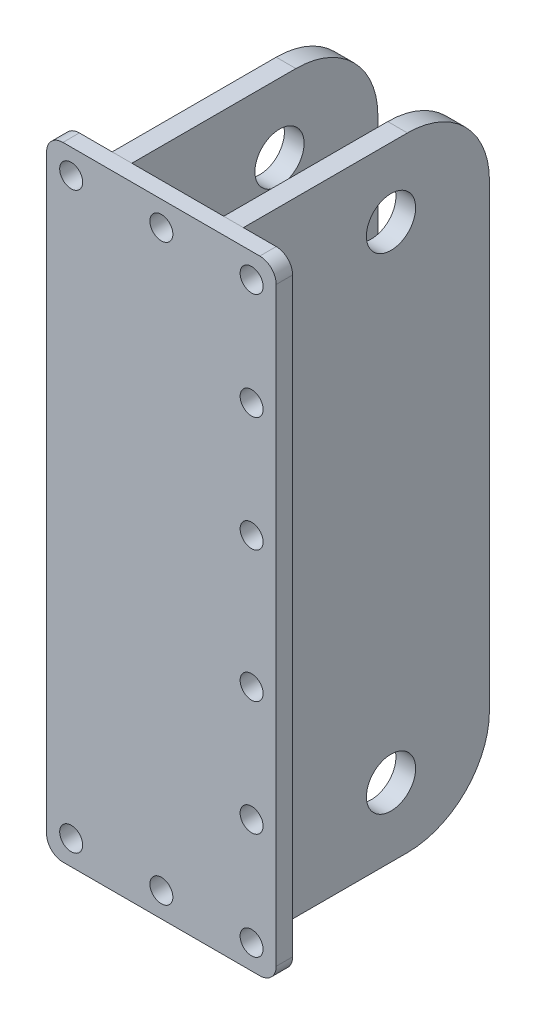
ISO-10303-21;
HEADER;
FILE_DESCRIPTION(('STEP AP214'),'2;1');
FILE_NAME('part.step','',(''),(''),'','','');
FILE_SCHEMA(('AUTOMOTIVE_DESIGN { 1 0 10303 214 1 1 1 1 }'));
ENDSEC;
DATA;
#1=APPLICATION_CONTEXT('core data for automotive mechanical design processes');
#2=APPLICATION_PROTOCOL_DEFINITION('international standard','automotive_design',2000,#1);
#3=PRODUCT_CONTEXT('',#1,'mechanical');
#4=PRODUCT('Part','Part','',(#3));
#5=PRODUCT_RELATED_PRODUCT_CATEGORY('part','',(#4));
#6=PRODUCT_DEFINITION_FORMATION('','',#4);
#7=PRODUCT_DEFINITION_CONTEXT('part definition',#1,'design');
#8=PRODUCT_DEFINITION('design','',#6,#7);
#9=PRODUCT_DEFINITION_SHAPE('','',#8);
#10=(LENGTH_UNIT() NAMED_UNIT(*) SI_UNIT(.MILLI.,.METRE.));
#11=(NAMED_UNIT(*) PLANE_ANGLE_UNIT() SI_UNIT($,.RADIAN.));
#12=(NAMED_UNIT(*) SI_UNIT($,.STERADIAN.) SOLID_ANGLE_UNIT());
#13=UNCERTAINTY_MEASURE_WITH_UNIT(LENGTH_MEASURE(1.E-05),#10,'distance_accuracy_value','');
#14=(GEOMETRIC_REPRESENTATION_CONTEXT(3) GLOBAL_UNCERTAINTY_ASSIGNED_CONTEXT((#13)) GLOBAL_UNIT_ASSIGNED_CONTEXT((#10,
#11,#12)) REPRESENTATION_CONTEXT('',''));
#15=CARTESIAN_POINT('',(0.,0.,0.));
#16=DIRECTION('',(0.,0.,1.));
#17=DIRECTION('',(1.,0.,0.));
#18=AXIS2_PLACEMENT_3D('',#15,#16,#17);
#19=CARTESIAN_POINT('',(42.,380.,-150.));
#20=DIRECTION('',(-1.,0.,0.));
#21=DIRECTION('',(0.,-1.,0.));
#22=AXIS2_PLACEMENT_3D('',#19,#20,#21);
#23=PLANE('',#22);
#24=CARTESIAN_POINT('',(42.,338.,-90.));
#25=DIRECTION('',(-1.,0.,0.));
#26=DIRECTION('',(0.,-1.,0.));
#27=AXIS2_PLACEMENT_3D('',#24,#25,#26);
#28=CIRCLE('',#27,15.);
#29=CARTESIAN_POINT('',(42.,323.,-90.));
#30=VERTEX_POINT('',#29);
#31=EDGE_CURVE('E116',#30,#30,#28,.F.);
#32=ORIENTED_EDGE('',*,*,#31,.F.);
#33=EDGE_LOOP('',(#32));
#34=FACE_BOUND('',#33,.T.);
#35=CARTESIAN_POINT('',(41.9999999999999,42.,-89.9999999999999));
#36=DIRECTION('',(-1.,0.,0.));
#37=DIRECTION('',(0.,-1.,0.));
#38=AXIS2_PLACEMENT_3D('',#35,#36,#37);
#39=CIRCLE('',#38,15.);
#40=CARTESIAN_POINT('',(41.9999999999999,27.,-89.9999999999999));
#41=VERTEX_POINT('',#40);
#42=EDGE_CURVE('E199',#41,#41,#39,.F.);
#43=ORIENTED_EDGE('',*,*,#42,.F.);
#44=EDGE_LOOP('',(#43));
#45=FACE_BOUND('',#44,.T.);
#46=DIRECTION('',(0.,0.,1.));
#47=VECTOR('',#46,1.);
#48=CARTESIAN_POINT('',(41.9999999999999,0.,-150.));
#49=LINE('',#48,#47);
#50=CARTESIAN_POINT('',(41.9999999999999,0.,-100.));
#51=VERTEX_POINT('',#50);
#52=CARTESIAN_POINT('',(41.9999999999999,0.,0.));
#53=VERTEX_POINT('',#52);
#54=EDGE_CURVE('E96',#51,#53,#49,.T.);
#55=ORIENTED_EDGE('',*,*,#54,.F.);
#56=CARTESIAN_POINT('',(42.,50.,-100.));
#57=DIRECTION('',(-1.,0.,0.));
#58=DIRECTION('',(0.,-1.,0.));
#59=AXIS2_PLACEMENT_3D('',#56,#57,#58);
#60=CIRCLE('',#59,50.);
#61=CARTESIAN_POINT('',(42.,50.,-150.));
#62=VERTEX_POINT('',#61);
#63=EDGE_CURVE('E53',#51,#62,#60,.F.);
#64=ORIENTED_EDGE('',*,*,#63,.T.);
#65=DIRECTION('',(0.,-1.,0.));
#66=VECTOR('',#65,1.);
#67=CARTESIAN_POINT('',(42.,380.,-150.));
#68=LINE('',#67,#66);
#69=CARTESIAN_POINT('',(42.,330.,-150.));
#70=VERTEX_POINT('',#69);
#71=EDGE_CURVE('E128',#70,#62,#68,.T.);
#72=ORIENTED_EDGE('',*,*,#71,.F.);
#73=CARTESIAN_POINT('',(42.,330.,-100.));
#74=DIRECTION('',(-1.,0.,0.));
#75=DIRECTION('',(0.,-1.,0.));
#76=AXIS2_PLACEMENT_3D('',#73,#74,#75);
#77=CIRCLE('',#76,50.);
#78=CARTESIAN_POINT('',(42.,380.,-100.));
#79=VERTEX_POINT('',#78);
#80=EDGE_CURVE('E60',#70,#79,#77,.F.);
#81=ORIENTED_EDGE('',*,*,#80,.T.);
#82=DIRECTION('',(0.,0.,1.));
#83=VECTOR('',#82,1.);
#84=CARTESIAN_POINT('',(42.,380.,-150.));
#85=LINE('',#84,#83);
#86=CARTESIAN_POINT('',(42.,380.,0.));
#87=VERTEX_POINT('',#86);
#88=EDGE_CURVE('E114',#79,#87,#85,.T.);
#89=ORIENTED_EDGE('',*,*,#88,.T.);
#90=DIRECTION('',(0.,-1.,0.));
#91=VECTOR('',#90,1.);
#92=CARTESIAN_POINT('',(42.,380.,0.));
#93=LINE('',#92,#91);
#94=EDGE_CURVE('E110',#87,#53,#93,.T.);
#95=ORIENTED_EDGE('',*,*,#94,.T.);
#96=EDGE_LOOP('',(#55,#64,#72,#81,#89,#95));
#97=FACE_BOUND('',#96,.T.);
#98=ADVANCED_FACE('F45',(#34,#45,#97),#23,.F.);
#99=CARTESIAN_POINT('',(41.9999999999999,0.,-150.));
#100=DIRECTION('',(0.,1.,0.));
#101=DIRECTION('',(-1.,0.,0.));
#102=AXIS2_PLACEMENT_3D('',#99,#100,#101);
#103=PLANE('',#102);
#104=DIRECTION('',(0.,0.,1.));
#105=VECTOR('',#104,1.);
#106=CARTESIAN_POINT('',(30.,0.,-150.));
#107=LINE('',#106,#105);
#108=CARTESIAN_POINT('',(30.,0.,-100.));
#109=VERTEX_POINT('',#108);
#110=CARTESIAN_POINT('',(30.,0.,0.));
#111=VERTEX_POINT('',#110);
#112=EDGE_CURVE('E104',#109,#111,#107,.T.);
#113=ORIENTED_EDGE('',*,*,#112,.F.);
#114=DIRECTION('',(-1.,0.,0.));
#115=VECTOR('',#114,1.);
#116=CARTESIAN_POINT('',(41.9999999999999,0.,-100.));
#117=LINE('',#116,#115);
#118=EDGE_CURVE('E68',#109,#51,#117,.F.);
#119=ORIENTED_EDGE('',*,*,#118,.T.);
#120=ORIENTED_EDGE('',*,*,#54,.T.);
#121=DIRECTION('',(-1.,0.,0.));
#122=VECTOR('',#121,1.);
#123=CARTESIAN_POINT('',(41.9999999999999,0.,0.));
#124=LINE('',#123,#122);
#125=EDGE_CURVE('E99',#53,#111,#124,.T.);
#126=ORIENTED_EDGE('',*,*,#125,.T.);
#127=EDGE_LOOP('',(#113,#119,#120,#126));
#128=FACE_BOUND('',#127,.T.);
#129=ADVANCED_FACE('F98',(#128),#103,.F.);
#130=CARTESIAN_POINT('',(30.,380.,-150.));
#131=DIRECTION('',(1.,0.,0.));
#132=DIRECTION('',(0.,1.,0.));
#133=AXIS2_PLACEMENT_3D('',#130,#131,#132);
#134=PLANE('',#133);
#135=CARTESIAN_POINT('',(30.,338.,-90.));
#136=DIRECTION('',(-1.,0.,0.));
#137=DIRECTION('',(0.,-1.,0.));
#138=AXIS2_PLACEMENT_3D('',#135,#136,#137);
#139=CIRCLE('',#138,15.);
#140=CARTESIAN_POINT('',(30.,323.,-90.));
#141=VERTEX_POINT('',#140);
#142=EDGE_CURVE('E119',#141,#141,#139,.T.);
#143=ORIENTED_EDGE('',*,*,#142,.F.);
#144=EDGE_LOOP('',(#143));
#145=FACE_BOUND('',#144,.T.);
#146=CARTESIAN_POINT('',(30.,42.,-89.9999999999999));
#147=DIRECTION('',(-1.,0.,0.));
#148=DIRECTION('',(0.,-1.,0.));
#149=AXIS2_PLACEMENT_3D('',#146,#147,#148);
#150=CIRCLE('',#149,15.);
#151=CARTESIAN_POINT('',(30.,27.,-89.9999999999999));
#152=VERTEX_POINT('',#151);
#153=EDGE_CURVE('E202',#152,#152,#150,.T.);
#154=ORIENTED_EDGE('',*,*,#153,.F.);
#155=EDGE_LOOP('',(#154));
#156=FACE_BOUND('',#155,.T.);
#157=DIRECTION('',(0.,1.,0.));
#158=VECTOR('',#157,1.);
#159=CARTESIAN_POINT('',(30.,380.,-150.));
#160=LINE('',#159,#158);
#161=CARTESIAN_POINT('',(30.,50.,-150.));
#162=VERTEX_POINT('',#161);
#163=CARTESIAN_POINT('',(30.,330.,-150.));
#164=VERTEX_POINT('',#163);
#165=EDGE_CURVE('E122',#162,#164,#160,.T.);
#166=ORIENTED_EDGE('',*,*,#165,.F.);
#167=CARTESIAN_POINT('',(30.,50.,-100.));
#168=DIRECTION('',(1.,0.,0.));
#169=DIRECTION('',(0.,1.,0.));
#170=AXIS2_PLACEMENT_3D('',#167,#168,#169);
#171=CIRCLE('',#170,50.);
#172=EDGE_CURVE('E140',#162,#109,#171,.F.);
#173=ORIENTED_EDGE('',*,*,#172,.T.);
#174=ORIENTED_EDGE('',*,*,#112,.T.);
#175=DIRECTION('',(0.,1.,0.));
#176=VECTOR('',#175,1.);
#177=CARTESIAN_POINT('',(30.,380.,0.));
#178=LINE('',#177,#176);
#179=CARTESIAN_POINT('',(30.,380.,0.));
#180=VERTEX_POINT('',#179);
#181=EDGE_CURVE('E112',#111,#180,#178,.T.);
#182=ORIENTED_EDGE('',*,*,#181,.T.);
#183=DIRECTION('',(0.,0.,1.));
#184=VECTOR('',#183,1.);
#185=CARTESIAN_POINT('',(30.,380.,-150.));
#186=LINE('',#185,#184);
#187=CARTESIAN_POINT('',(30.,380.,-100.));
#188=VERTEX_POINT('',#187);
#189=EDGE_CURVE('E130',#188,#180,#186,.T.);
#190=ORIENTED_EDGE('',*,*,#189,.F.);
#191=CARTESIAN_POINT('',(30.,330.,-100.));
#192=DIRECTION('',(1.,0.,0.));
#193=DIRECTION('',(0.,1.,0.));
#194=AXIS2_PLACEMENT_3D('',#191,#192,#193);
#195=CIRCLE('',#194,50.);
#196=EDGE_CURVE('E138',#188,#164,#195,.F.);
#197=ORIENTED_EDGE('',*,*,#196,.T.);
#198=EDGE_LOOP('',(#166,#173,#174,#182,#190,#197));
#199=FACE_BOUND('',#198,.T.);
#200=ADVANCED_FACE('F153',(#145,#156,#199),#134,.F.);
#201=CARTESIAN_POINT('',(42.,380.,-150.));
#202=DIRECTION('',(0.,-1.,0.));
#203=DIRECTION('',(0.,0.,-1.));
#204=AXIS2_PLACEMENT_3D('',#201,#202,#203);
#205=PLANE('',#204);
#206=ORIENTED_EDGE('',*,*,#88,.F.);
#207=DIRECTION('',(1.,0.,0.));
#208=VECTOR('',#207,1.);
#209=CARTESIAN_POINT('',(30.,380.,-100.));
#210=LINE('',#209,#208);
#211=EDGE_CURVE('E12',#79,#188,#210,.F.);
#212=ORIENTED_EDGE('',*,*,#211,.T.);
#213=ORIENTED_EDGE('',*,*,#189,.T.);
#214=DIRECTION('',(1.,0.,0.));
#215=VECTOR('',#214,1.);
#216=CARTESIAN_POINT('',(42.,380.,0.));
#217=LINE('',#216,#215);
#218=EDGE_CURVE('E126',#180,#87,#217,.T.);
#219=ORIENTED_EDGE('',*,*,#218,.T.);
#220=EDGE_LOOP('',(#206,#212,#213,#219));
#221=FACE_BOUND('',#220,.T.);
#222=ADVANCED_FACE('F159',(#221),#205,.F.);
#223=CARTESIAN_POINT('',(0.,0.,-150.));
#224=DIRECTION('',(0.,0.,-1.));
#225=DIRECTION('',(-1.,0.,0.));
#226=AXIS2_PLACEMENT_3D('',#223,#224,#225);
#227=PLANE('',#226);
#228=ORIENTED_EDGE('',*,*,#71,.T.);
#229=DIRECTION('',(-1.,0.,0.));
#230=VECTOR('',#229,1.);
#231=CARTESIAN_POINT('',(30.,50.,-150.));
#232=LINE('',#231,#230);
#233=EDGE_CURVE('E135',#62,#162,#232,.T.);
#234=ORIENTED_EDGE('',*,*,#233,.T.);
#235=ORIENTED_EDGE('',*,*,#165,.T.);
#236=DIRECTION('',(1.,0.,0.));
#237=VECTOR('',#236,1.);
#238=CARTESIAN_POINT('',(42.,330.,-150.));
#239=LINE('',#238,#237);
#240=EDGE_CURVE('E103',#164,#70,#239,.T.);
#241=ORIENTED_EDGE('',*,*,#240,.T.);
#242=EDGE_LOOP('',(#228,#234,#235,#241));
#243=FACE_BOUND('',#242,.T.);
#244=ADVANCED_FACE('F147',(#243),#227,.T.);
#245=CARTESIAN_POINT('',(0.,0.,0.));
#246=DIRECTION('',(0.,0.,-1.));
#247=DIRECTION('',(-1.,0.,0.));
#248=AXIS2_PLACEMENT_3D('',#245,#246,#247);
#249=PLANE('',#248);
#250=ORIENTED_EDGE('',*,*,#94,.F.);
#251=ORIENTED_EDGE('',*,*,#218,.F.);
#252=ORIENTED_EDGE('',*,*,#181,.F.);
#253=ORIENTED_EDGE('',*,*,#125,.F.);
#254=EDGE_LOOP('',(#250,#251,#252,#253));
#255=FACE_BOUND('',#254,.T.);
#256=ADVANCED_FACE('F108',(#255),#249,.F.);
#257=CARTESIAN_POINT('',(0.,50.,-100.));
#258=DIRECTION('',(1.,0.,0.));
#259=DIRECTION('',(0.,1.,0.));
#260=AXIS2_PLACEMENT_3D('',#257,#258,#259);
#261=CYLINDRICAL_SURFACE('',#260,50.);
#262=ORIENTED_EDGE('',*,*,#63,.F.);
#263=ORIENTED_EDGE('',*,*,#118,.F.);
#264=ORIENTED_EDGE('',*,*,#172,.F.);
#265=ORIENTED_EDGE('',*,*,#233,.F.);
#266=EDGE_LOOP('',(#262,#263,#264,#265));
#267=FACE_BOUND('',#266,.T.);
#268=ADVANCED_FACE('F151',(#267),#261,.T.);
#269=CARTESIAN_POINT('',(0.,330.,-100.));
#270=DIRECTION('',(-1.,0.,0.));
#271=DIRECTION('',(0.,0.,1.));
#272=AXIS2_PLACEMENT_3D('',#269,#270,#271);
#273=CYLINDRICAL_SURFACE('',#272,50.);
#274=ORIENTED_EDGE('',*,*,#196,.F.);
#275=ORIENTED_EDGE('',*,*,#211,.F.);
#276=ORIENTED_EDGE('',*,*,#80,.F.);
#277=ORIENTED_EDGE('',*,*,#240,.F.);
#278=EDGE_LOOP('',(#274,#275,#276,#277));
#279=FACE_BOUND('',#278,.T.);
#280=ADVANCED_FACE('F47',(#279),#273,.T.);
#281=CARTESIAN_POINT('',(140.001,42.,-89.9999999999999));
#282=DIRECTION('',(-1.,0.,0.));
#283=DIRECTION('',(0.,-1.,0.));
#284=AXIS2_PLACEMENT_3D('',#281,#282,#283);
#285=CYLINDRICAL_SURFACE('',#284,15.);
#286=ORIENTED_EDGE('',*,*,#153,.T.);
#287=EDGE_LOOP('',(#286));
#288=FACE_BOUND('',#287,.T.);
#289=ORIENTED_EDGE('',*,*,#42,.T.);
#290=EDGE_LOOP('',(#289));
#291=FACE_BOUND('',#290,.T.);
#292=ADVANCED_FACE('F184',(#288,#291),#285,.F.);
#293=CARTESIAN_POINT('',(140.001,338.,-90.));
#294=DIRECTION('',(-1.,0.,0.));
#295=DIRECTION('',(0.,-1.,0.));
#296=AXIS2_PLACEMENT_3D('',#293,#294,#295);
#297=CYLINDRICAL_SURFACE('',#296,15.);
#298=ORIENTED_EDGE('',*,*,#142,.T.);
#299=EDGE_LOOP('',(#298));
#300=FACE_BOUND('',#299,.T.);
#301=ORIENTED_EDGE('',*,*,#31,.T.);
#302=EDGE_LOOP('',(#301));
#303=FACE_BOUND('',#302,.T.);
#304=ADVANCED_FACE('F190',(#300,#303),#297,.F.);
#305=CLOSED_SHELL('',(#98,#129,#200,#222,#244,#256,#268,#280,#292,#304));
#306=MANIFOLD_SOLID_BREP('B2',#305);
#307=CARTESIAN_POINT('',(110.,380.,-150.));
#308=DIRECTION('',(-1.,0.,0.));
#309=DIRECTION('',(0.,-1.,0.));
#310=AXIS2_PLACEMENT_3D('',#307,#308,#309);
#311=PLANE('',#310);
#312=CARTESIAN_POINT('',(110.,338.,-90.));
#313=DIRECTION('',(1.,0.,0.));
#314=DIRECTION('',(0.,1.,0.));
#315=AXIS2_PLACEMENT_3D('',#312,#313,#314);
#316=CIRCLE('',#315,15.);
#317=CARTESIAN_POINT('',(110.,353.,-90.));
#318=VERTEX_POINT('',#317);
#319=EDGE_CURVE('E350',#318,#318,#316,.T.);
#320=ORIENTED_EDGE('',*,*,#319,.F.);
#321=EDGE_LOOP('',(#320));
#322=FACE_BOUND('',#321,.T.);
#323=CARTESIAN_POINT('',(110.,42.,-90.0000000000001));
#324=DIRECTION('',(1.,0.,0.));
#325=DIRECTION('',(0.,1.,0.));
#326=AXIS2_PLACEMENT_3D('',#323,#324,#325);
#327=CIRCLE('',#326,15.);
#328=CARTESIAN_POINT('',(110.,57.,-90.0000000000001));
#329=VERTEX_POINT('',#328);
#330=EDGE_CURVE('E390',#329,#329,#327,.T.);
#331=ORIENTED_EDGE('',*,*,#330,.F.);
#332=EDGE_LOOP('',(#331));
#333=FACE_BOUND('',#332,.T.);
#334=DIRECTION('',(0.,-1.,0.));
#335=VECTOR('',#334,1.);
#336=CARTESIAN_POINT('',(110.,380.,-150.));
#337=LINE('',#336,#335);
#338=CARTESIAN_POINT('',(110.,330.,-150.));
#339=VERTEX_POINT('',#338);
#340=CARTESIAN_POINT('',(110.,50.,-150.));
#341=VERTEX_POINT('',#340);
#342=EDGE_CURVE('E359',#339,#341,#337,.T.);
#343=ORIENTED_EDGE('',*,*,#342,.F.);
#344=CARTESIAN_POINT('',(110.,330.,-100.));
#345=DIRECTION('',(-1.,0.,0.));
#346=DIRECTION('',(0.,-1.,0.));
#347=AXIS2_PLACEMENT_3D('',#344,#345,#346);
#348=CIRCLE('',#347,50.);
#349=CARTESIAN_POINT('',(110.,380.,-100.));
#350=VERTEX_POINT('',#349);
#351=EDGE_CURVE('E371',#339,#350,#348,.F.);
#352=ORIENTED_EDGE('',*,*,#351,.T.);
#353=DIRECTION('',(0.,0.,1.));
#354=VECTOR('',#353,1.);
#355=CARTESIAN_POINT('',(110.,380.,-150.));
#356=LINE('',#355,#354);
#357=CARTESIAN_POINT('',(110.,380.,0.));
#358=VERTEX_POINT('',#357);
#359=EDGE_CURVE('E345',#350,#358,#356,.T.);
#360=ORIENTED_EDGE('',*,*,#359,.T.);
#361=DIRECTION('',(0.,-1.,0.));
#362=VECTOR('',#361,1.);
#363=CARTESIAN_POINT('',(110.,380.,0.));
#364=LINE('',#363,#362);
#365=CARTESIAN_POINT('',(110.,0.,0.));
#366=VERTEX_POINT('',#365);
#367=EDGE_CURVE('E340',#358,#366,#364,.T.);
#368=ORIENTED_EDGE('',*,*,#367,.T.);
#369=DIRECTION('',(0.,0.,1.));
#370=VECTOR('',#369,1.);
#371=CARTESIAN_POINT('',(110.,0.,-150.));
#372=LINE('',#371,#370);
#373=CARTESIAN_POINT('',(110.,0.,-100.));
#374=VERTEX_POINT('',#373);
#375=EDGE_CURVE('E324',#374,#366,#372,.T.);
#376=ORIENTED_EDGE('',*,*,#375,.F.);
#377=CARTESIAN_POINT('',(110.,50.,-100.));
#378=DIRECTION('',(-1.,0.,0.));
#379=DIRECTION('',(0.,-1.,0.));
#380=AXIS2_PLACEMENT_3D('',#377,#378,#379);
#381=CIRCLE('',#380,50.);
#382=EDGE_CURVE('E369',#374,#341,#381,.F.);
#383=ORIENTED_EDGE('',*,*,#382,.T.);
#384=EDGE_LOOP('',(#343,#352,#360,#368,#376,#383));
#385=FACE_BOUND('',#384,.T.);
#386=ADVANCED_FACE('F271',(#322,#333,#385),#311,.F.);
#387=CARTESIAN_POINT('',(110.,0.,-150.));
#388=DIRECTION('',(0.,1.,0.));
#389=DIRECTION('',(0.,0.,1.));
#390=AXIS2_PLACEMENT_3D('',#387,#388,#389);
#391=PLANE('',#390);
#392=DIRECTION('',(0.,0.,1.));
#393=VECTOR('',#392,1.);
#394=CARTESIAN_POINT('',(98.,0.,-150.));
#395=LINE('',#394,#393);
#396=CARTESIAN_POINT('',(98.,0.,-100.));
#397=VERTEX_POINT('',#396);
#398=CARTESIAN_POINT('',(98.,0.,0.));
#399=VERTEX_POINT('',#398);
#400=EDGE_CURVE('E334',#397,#399,#395,.T.);
#401=ORIENTED_EDGE('',*,*,#400,.F.);
#402=DIRECTION('',(-1.,0.,0.));
#403=VECTOR('',#402,1.);
#404=CARTESIAN_POINT('',(110.,0.,-100.));
#405=LINE('',#404,#403);
#406=EDGE_CURVE('E43',#397,#374,#405,.F.);
#407=ORIENTED_EDGE('',*,*,#406,.T.);
#408=ORIENTED_EDGE('',*,*,#375,.T.);
#409=DIRECTION('',(-1.,0.,0.));
#410=VECTOR('',#409,1.);
#411=CARTESIAN_POINT('',(110.,0.,0.));
#412=LINE('',#411,#410);
#413=EDGE_CURVE('E327',#366,#399,#412,.T.);
#414=ORIENTED_EDGE('',*,*,#413,.T.);
#415=EDGE_LOOP('',(#401,#407,#408,#414));
#416=FACE_BOUND('',#415,.T.);
#417=ADVANCED_FACE('F326',(#416),#391,.F.);
#418=CARTESIAN_POINT('',(98.,380.,-150.));
#419=DIRECTION('',(1.,0.,0.));
#420=DIRECTION('',(0.,1.,0.));
#421=AXIS2_PLACEMENT_3D('',#418,#419,#420);
#422=PLANE('',#421);
#423=CARTESIAN_POINT('',(98.,338.,-90.));
#424=DIRECTION('',(1.,0.,0.));
#425=DIRECTION('',(0.,1.,0.));
#426=AXIS2_PLACEMENT_3D('',#423,#424,#425);
#427=CIRCLE('',#426,15.);
#428=CARTESIAN_POINT('',(98.,353.,-90.));
#429=VERTEX_POINT('',#428);
#430=EDGE_CURVE('E347',#429,#429,#427,.F.);
#431=ORIENTED_EDGE('',*,*,#430,.F.);
#432=EDGE_LOOP('',(#431));
#433=FACE_BOUND('',#432,.T.);
#434=CARTESIAN_POINT('',(98.,42.,-90.0000000000001));
#435=DIRECTION('',(1.,0.,0.));
#436=DIRECTION('',(0.,1.,0.));
#437=AXIS2_PLACEMENT_3D('',#434,#435,#436);
#438=CIRCLE('',#437,15.);
#439=CARTESIAN_POINT('',(98.,57.,-90.0000000000001));
#440=VERTEX_POINT('',#439);
#441=EDGE_CURVE('E387',#440,#440,#438,.F.);
#442=ORIENTED_EDGE('',*,*,#441,.F.);
#443=EDGE_LOOP('',(#442));
#444=FACE_BOUND('',#443,.T.);
#445=DIRECTION('',(0.,0.,1.));
#446=VECTOR('',#445,1.);
#447=CARTESIAN_POINT('',(98.,380.,-150.));
#448=LINE('',#447,#446);
#449=CARTESIAN_POINT('',(98.,380.,-100.));
#450=VERTEX_POINT('',#449);
#451=CARTESIAN_POINT('',(98.,380.,0.));
#452=VERTEX_POINT('',#451);
#453=EDGE_CURVE('E361',#450,#452,#448,.T.);
#454=ORIENTED_EDGE('',*,*,#453,.F.);
#455=CARTESIAN_POINT('',(98.,330.,-100.));
#456=DIRECTION('',(1.,0.,0.));
#457=DIRECTION('',(0.,1.,0.));
#458=AXIS2_PLACEMENT_3D('',#455,#456,#457);
#459=CIRCLE('',#458,50.);
#460=CARTESIAN_POINT('',(98.,330.,-150.));
#461=VERTEX_POINT('',#460);
#462=EDGE_CURVE('E279',#450,#461,#459,.F.);
#463=ORIENTED_EDGE('',*,*,#462,.T.);
#464=DIRECTION('',(0.,1.,0.));
#465=VECTOR('',#464,1.);
#466=CARTESIAN_POINT('',(98.,380.,-150.));
#467=LINE('',#466,#465);
#468=CARTESIAN_POINT('',(98.,50.,-150.));
#469=VERTEX_POINT('',#468);
#470=EDGE_CURVE('E353',#469,#461,#467,.T.);
#471=ORIENTED_EDGE('',*,*,#470,.F.);
#472=CARTESIAN_POINT('',(98.,50.,-100.));
#473=DIRECTION('',(1.,0.,0.));
#474=DIRECTION('',(0.,1.,0.));
#475=AXIS2_PLACEMENT_3D('',#472,#473,#474);
#476=CIRCLE('',#475,50.);
#477=EDGE_CURVE('E286',#469,#397,#476,.F.);
#478=ORIENTED_EDGE('',*,*,#477,.T.);
#479=ORIENTED_EDGE('',*,*,#400,.T.);
#480=DIRECTION('',(0.,1.,0.));
#481=VECTOR('',#480,1.);
#482=CARTESIAN_POINT('',(98.,380.,0.));
#483=LINE('',#482,#481);
#484=EDGE_CURVE('E342',#399,#452,#483,.T.);
#485=ORIENTED_EDGE('',*,*,#484,.T.);
#486=EDGE_LOOP('',(#454,#463,#471,#478,#479,#485));
#487=FACE_BOUND('',#486,.T.);
#488=ADVANCED_FACE('F376',(#433,#444,#487),#422,.F.);
#489=CARTESIAN_POINT('',(110.,380.,-150.));
#490=DIRECTION('',(0.,-1.,0.));
#491=DIRECTION('',(0.,0.,-1.));
#492=AXIS2_PLACEMENT_3D('',#489,#490,#491);
#493=PLANE('',#492);
#494=ORIENTED_EDGE('',*,*,#359,.F.);
#495=DIRECTION('',(1.,0.,0.));
#496=VECTOR('',#495,1.);
#497=CARTESIAN_POINT('',(98.,380.,-100.));
#498=LINE('',#497,#496);
#499=EDGE_CURVE('E294',#350,#450,#498,.F.);
#500=ORIENTED_EDGE('',*,*,#499,.T.);
#501=ORIENTED_EDGE('',*,*,#453,.T.);
#502=DIRECTION('',(1.,0.,0.));
#503=VECTOR('',#502,1.);
#504=CARTESIAN_POINT('',(110.,380.,0.));
#505=LINE('',#504,#503);
#506=EDGE_CURVE('E357',#452,#358,#505,.T.);
#507=ORIENTED_EDGE('',*,*,#506,.T.);
#508=EDGE_LOOP('',(#494,#500,#501,#507));
#509=FACE_BOUND('',#508,.T.);
#510=ADVANCED_FACE('F384',(#509),#493,.F.);
#511=CARTESIAN_POINT('',(0.,0.,-150.));
#512=DIRECTION('',(0.,0.,-1.));
#513=DIRECTION('',(-1.,0.,0.));
#514=AXIS2_PLACEMENT_3D('',#511,#512,#513);
#515=PLANE('',#514);
#516=ORIENTED_EDGE('',*,*,#470,.T.);
#517=DIRECTION('',(1.,0.,0.));
#518=VECTOR('',#517,1.);
#519=CARTESIAN_POINT('',(110.,330.,-150.));
#520=LINE('',#519,#518);
#521=EDGE_CURVE('E366',#461,#339,#520,.T.);
#522=ORIENTED_EDGE('',*,*,#521,.T.);
#523=ORIENTED_EDGE('',*,*,#342,.T.);
#524=DIRECTION('',(-1.,0.,0.));
#525=VECTOR('',#524,1.);
#526=CARTESIAN_POINT('',(98.,50.,-150.));
#527=LINE('',#526,#525);
#528=EDGE_CURVE('E333',#341,#469,#527,.T.);
#529=ORIENTED_EDGE('',*,*,#528,.T.);
#530=EDGE_LOOP('',(#516,#522,#523,#529));
#531=FACE_BOUND('',#530,.T.);
#532=ADVANCED_FACE('F380',(#531),#515,.T.);
#533=CARTESIAN_POINT('',(0.,0.,0.));
#534=DIRECTION('',(0.,0.,-1.));
#535=DIRECTION('',(-1.,0.,0.));
#536=AXIS2_PLACEMENT_3D('',#533,#534,#535);
#537=PLANE('',#536);
#538=ORIENTED_EDGE('',*,*,#367,.F.);
#539=ORIENTED_EDGE('',*,*,#506,.F.);
#540=ORIENTED_EDGE('',*,*,#484,.F.);
#541=ORIENTED_EDGE('',*,*,#413,.F.);
#542=EDGE_LOOP('',(#538,#539,#540,#541));
#543=FACE_BOUND('',#542,.T.);
#544=ADVANCED_FACE('F338',(#543),#537,.F.);
#545=CARTESIAN_POINT('',(0.,330.,-100.));
#546=DIRECTION('',(-1.,0.,0.));
#547=DIRECTION('',(0.,0.,1.));
#548=AXIS2_PLACEMENT_3D('',#545,#546,#547);
#549=CYLINDRICAL_SURFACE('',#548,50.);
#550=ORIENTED_EDGE('',*,*,#462,.F.);
#551=ORIENTED_EDGE('',*,*,#499,.F.);
#552=ORIENTED_EDGE('',*,*,#351,.F.);
#553=ORIENTED_EDGE('',*,*,#521,.F.);
#554=EDGE_LOOP('',(#550,#551,#552,#553));
#555=FACE_BOUND('',#554,.T.);
#556=ADVANCED_FACE('F383',(#555),#549,.T.);
#557=CARTESIAN_POINT('',(0.,50.,-100.));
#558=DIRECTION('',(1.,0.,0.));
#559=DIRECTION('',(0.,0.,-1.));
#560=AXIS2_PLACEMENT_3D('',#557,#558,#559);
#561=CYLINDRICAL_SURFACE('',#560,50.);
#562=ORIENTED_EDGE('',*,*,#382,.F.);
#563=ORIENTED_EDGE('',*,*,#406,.F.);
#564=ORIENTED_EDGE('',*,*,#477,.F.);
#565=ORIENTED_EDGE('',*,*,#528,.F.);
#566=EDGE_LOOP('',(#562,#563,#564,#565));
#567=FACE_BOUND('',#566,.T.);
#568=ADVANCED_FACE('F273',(#567),#561,.T.);
#569=CARTESIAN_POINT('',(-0.00100000000004263,42.,-90.0000000000001));
#570=DIRECTION('',(1.,0.,0.));
#571=DIRECTION('',(0.,1.,0.));
#572=AXIS2_PLACEMENT_3D('',#569,#570,#571);
#573=CYLINDRICAL_SURFACE('',#572,15.);
#574=ORIENTED_EDGE('',*,*,#330,.T.);
#575=EDGE_LOOP('',(#574));
#576=FACE_BOUND('',#575,.T.);
#577=ORIENTED_EDGE('',*,*,#441,.T.);
#578=EDGE_LOOP('',(#577));
#579=FACE_BOUND('',#578,.T.);
#580=ADVANCED_FACE('F404',(#576,#579),#573,.F.);
#581=CARTESIAN_POINT('',(-0.001000000000001,338.,-90.));
#582=DIRECTION('',(1.,0.,0.));
#583=DIRECTION('',(0.,1.,0.));
#584=AXIS2_PLACEMENT_3D('',#581,#582,#583);
#585=CYLINDRICAL_SURFACE('',#584,15.);
#586=ORIENTED_EDGE('',*,*,#319,.T.);
#587=EDGE_LOOP('',(#586));
#588=FACE_BOUND('',#587,.T.);
#589=ORIENTED_EDGE('',*,*,#430,.T.);
#590=EDGE_LOOP('',(#589));
#591=FACE_BOUND('',#590,.T.);
#592=ADVANCED_FACE('F396',(#588,#591),#585,.F.);
#593=CLOSED_SHELL('',(#386,#417,#488,#510,#532,#544,#556,#568,#580,#592));
#594=MANIFOLD_SOLID_BREP('B6',#593);
#595=CARTESIAN_POINT('',(130.,10.,10.));
#596=DIRECTION('',(0.,0.,-1.));
#597=DIRECTION('',(-1.,0.,0.));
#598=AXIS2_PLACEMENT_3D('',#595,#596,#597);
#599=CYLINDRICAL_SURFACE('',#598,10.);
#600=CARTESIAN_POINT('',(130.,10.,0.));
#601=DIRECTION('',(0.,0.,1.));
#602=DIRECTION('',(1.,0.,0.));
#603=AXIS2_PLACEMENT_3D('',#600,#601,#602);
#604=CIRCLE('',#603,10.);
#605=CARTESIAN_POINT('',(130.,0.,0.));
#606=VERTEX_POINT('',#605);
#607=CARTESIAN_POINT('',(140.,10.,0.));
#608=VERTEX_POINT('',#607);
#609=EDGE_CURVE('E584',#606,#608,#604,.T.);
#610=ORIENTED_EDGE('',*,*,#609,.T.);
#611=DIRECTION('',(0.,0.,-1.));
#612=VECTOR('',#611,1.);
#613=CARTESIAN_POINT('',(140.,10.,10.));
#614=LINE('',#613,#612);
#615=CARTESIAN_POINT('',(140.,10.,10.));
#616=VERTEX_POINT('',#615);
#617=EDGE_CURVE('E269',#616,#608,#614,.T.);
#618=ORIENTED_EDGE('',*,*,#617,.F.);
#619=CARTESIAN_POINT('',(130.,10.,10.));
#620=DIRECTION('',(0.,0.,1.));
#621=DIRECTION('',(1.,0.,0.));
#622=AXIS2_PLACEMENT_3D('',#619,#620,#621);
#623=CIRCLE('',#622,10.);
#624=CARTESIAN_POINT('',(130.,0.,10.));
#625=VERTEX_POINT('',#624);
#626=EDGE_CURVE('E599',#625,#616,#623,.T.);
#627=ORIENTED_EDGE('',*,*,#626,.F.);
#628=DIRECTION('',(0.,0.,-1.));
#629=VECTOR('',#628,1.);
#630=CARTESIAN_POINT('',(130.,0.,10.));
#631=LINE('',#630,#629);
#632=EDGE_CURVE('E580',#625,#606,#631,.T.);
#633=ORIENTED_EDGE('',*,*,#632,.T.);
#634=EDGE_LOOP('',(#610,#618,#627,#633));
#635=FACE_BOUND('',#634,.T.);
#636=ADVANCED_FACE('F488',(#635),#599,.T.);
#637=CARTESIAN_POINT('',(140.,10.,10.));
#638=DIRECTION('',(-1.,0.,0.));
#639=DIRECTION('',(0.,0.,1.));
#640=AXIS2_PLACEMENT_3D('',#637,#638,#639);
#641=PLANE('',#640);
#642=DIRECTION('',(0.,1.,0.));
#643=VECTOR('',#642,1.);
#644=CARTESIAN_POINT('',(140.,10.,0.));
#645=LINE('',#644,#643);
#646=CARTESIAN_POINT('',(140.,370.,0.));
#647=VERTEX_POINT('',#646);
#648=EDGE_CURVE('E587',#608,#647,#645,.T.);
#649=ORIENTED_EDGE('',*,*,#648,.T.);
#650=DIRECTION('',(0.,0.,-1.));
#651=VECTOR('',#650,1.);
#652=CARTESIAN_POINT('',(140.,370.,10.));
#653=LINE('',#652,#651);
#654=CARTESIAN_POINT('',(140.,370.,10.));
#655=VERTEX_POINT('',#654);
#656=EDGE_CURVE('E496',#655,#647,#653,.T.);
#657=ORIENTED_EDGE('',*,*,#656,.F.);
#658=DIRECTION('',(0.,1.,0.));
#659=VECTOR('',#658,1.);
#660=CARTESIAN_POINT('',(140.,10.,10.));
#661=LINE('',#660,#659);
#662=EDGE_CURVE('E547',#616,#655,#661,.T.);
#663=ORIENTED_EDGE('',*,*,#662,.F.);
#664=ORIENTED_EDGE('',*,*,#617,.T.);
#665=EDGE_LOOP('',(#649,#657,#663,#664));
#666=FACE_BOUND('',#665,.T.);
#667=ADVANCED_FACE('F717',(#666),#641,.F.);
#668=CARTESIAN_POINT('',(130.,370.,10.));
#669=DIRECTION('',(0.,0.,-1.));
#670=DIRECTION('',(-1.,0.,0.));
#671=AXIS2_PLACEMENT_3D('',#668,#669,#670);
#672=CYLINDRICAL_SURFACE('',#671,10.);
#673=CARTESIAN_POINT('',(130.,370.,0.));
#674=DIRECTION('',(0.,0.,1.));
#675=DIRECTION('',(-1.,0.,0.));
#676=AXIS2_PLACEMENT_3D('',#673,#674,#675);
#677=CIRCLE('',#676,10.);
#678=CARTESIAN_POINT('',(130.,380.,0.));
#679=VERTEX_POINT('',#678);
#680=EDGE_CURVE('E590',#647,#679,#677,.T.);
#681=ORIENTED_EDGE('',*,*,#680,.T.);
#682=DIRECTION('',(0.,0.,-1.));
#683=VECTOR('',#682,1.);
#684=CARTESIAN_POINT('',(130.,380.,10.));
#685=LINE('',#684,#683);
#686=CARTESIAN_POINT('',(130.,380.,10.));
#687=VERTEX_POINT('',#686);
#688=EDGE_CURVE('E606',#687,#679,#685,.T.);
#689=ORIENTED_EDGE('',*,*,#688,.F.);
#690=CARTESIAN_POINT('',(130.,370.,10.));
#691=DIRECTION('',(0.,0.,1.));
#692=DIRECTION('',(-1.,0.,0.));
#693=AXIS2_PLACEMENT_3D('',#690,#691,#692);
#694=CIRCLE('',#693,10.);
#695=EDGE_CURVE('E614',#655,#687,#694,.T.);
#696=ORIENTED_EDGE('',*,*,#695,.F.);
#697=ORIENTED_EDGE('',*,*,#656,.T.);
#698=EDGE_LOOP('',(#681,#689,#696,#697));
#699=FACE_BOUND('',#698,.T.);
#700=ADVANCED_FACE('F612',(#699),#672,.T.);
#701=CARTESIAN_POINT('',(10.,380.,10.));
#702=DIRECTION('',(0.,-1.,0.));
#703=DIRECTION('',(0.,0.,-1.));
#704=AXIS2_PLACEMENT_3D('',#701,#702,#703);
#705=PLANE('',#704);
#706=DIRECTION('',(-1.,0.,0.));
#707=VECTOR('',#706,1.);
#708=CARTESIAN_POINT('',(10.,380.,0.));
#709=LINE('',#708,#707);
#710=CARTESIAN_POINT('',(10.,380.,0.));
#711=VERTEX_POINT('',#710);
#712=EDGE_CURVE('E592',#679,#711,#709,.T.);
#713=ORIENTED_EDGE('',*,*,#712,.T.);
#714=DIRECTION('',(0.,0.,-1.));
#715=VECTOR('',#714,1.);
#716=CARTESIAN_POINT('',(10.,380.,10.));
#717=LINE('',#716,#715);
#718=CARTESIAN_POINT('',(10.,380.,10.));
#719=VERTEX_POINT('',#718);
#720=EDGE_CURVE('E603',#719,#711,#717,.T.);
#721=ORIENTED_EDGE('',*,*,#720,.F.);
#722=DIRECTION('',(-1.,0.,0.));
#723=VECTOR('',#722,1.);
#724=CARTESIAN_POINT('',(10.,380.,10.));
#725=LINE('',#724,#723);
#726=EDGE_CURVE('E626',#687,#719,#725,.T.);
#727=ORIENTED_EDGE('',*,*,#726,.F.);
#728=ORIENTED_EDGE('',*,*,#688,.T.);
#729=EDGE_LOOP('',(#713,#721,#727,#728));
#730=FACE_BOUND('',#729,.T.);
#731=ADVANCED_FACE('F622',(#730),#705,.F.);
#732=CARTESIAN_POINT('',(10.,370.,10.));
#733=DIRECTION('',(0.,0.,-1.));
#734=DIRECTION('',(-1.,0.,0.));
#735=AXIS2_PLACEMENT_3D('',#732,#733,#734);
#736=CYLINDRICAL_SURFACE('',#735,10.);
#737=CARTESIAN_POINT('',(10.,370.,0.));
#738=DIRECTION('',(0.,0.,1.));
#739=DIRECTION('',(-1.,0.,0.));
#740=AXIS2_PLACEMENT_3D('',#737,#738,#739);
#741=CIRCLE('',#740,10.);
#742=CARTESIAN_POINT('',(0.,370.,0.));
#743=VERTEX_POINT('',#742);
#744=EDGE_CURVE('E594',#711,#743,#741,.T.);
#745=ORIENTED_EDGE('',*,*,#744,.T.);
#746=DIRECTION('',(0.,0.,-1.));
#747=VECTOR('',#746,1.);
#748=CARTESIAN_POINT('',(0.,370.,10.));
#749=LINE('',#748,#747);
#750=CARTESIAN_POINT('',(0.,370.,10.));
#751=VERTEX_POINT('',#750);
#752=EDGE_CURVE('E575',#751,#743,#749,.T.);
#753=ORIENTED_EDGE('',*,*,#752,.F.);
#754=CARTESIAN_POINT('',(10.,370.,10.));
#755=DIRECTION('',(0.,0.,1.));
#756=DIRECTION('',(-1.,0.,0.));
#757=AXIS2_PLACEMENT_3D('',#754,#755,#756);
#758=CIRCLE('',#757,10.);
#759=EDGE_CURVE('E566',#719,#751,#758,.T.);
#760=ORIENTED_EDGE('',*,*,#759,.F.);
#761=ORIENTED_EDGE('',*,*,#720,.T.);
#762=EDGE_LOOP('',(#745,#753,#760,#761));
#763=FACE_BOUND('',#762,.T.);
#764=ADVANCED_FACE('F625',(#763),#736,.T.);
#765=CARTESIAN_POINT('',(0.,10.0000000000001,10.));
#766=DIRECTION('',(1.,0.,0.));
#767=DIRECTION('',(0.,0.,-1.));
#768=AXIS2_PLACEMENT_3D('',#765,#766,#767);
#769=PLANE('',#768);
#770=DIRECTION('',(0.,-1.,0.));
#771=VECTOR('',#770,1.);
#772=CARTESIAN_POINT('',(0.,10.0000000000001,0.));
#773=LINE('',#772,#771);
#774=CARTESIAN_POINT('',(0.,10.,0.));
#775=VERTEX_POINT('',#774);
#776=EDGE_CURVE('E574',#743,#775,#773,.T.);
#777=ORIENTED_EDGE('',*,*,#776,.T.);
#778=DIRECTION('',(0.,0.,-1.));
#779=VECTOR('',#778,1.);
#780=CARTESIAN_POINT('',(0.,10.,10.));
#781=LINE('',#780,#779);
#782=CARTESIAN_POINT('',(0.,10.,10.));
#783=VERTEX_POINT('',#782);
#784=EDGE_CURVE('E571',#783,#775,#781,.T.);
#785=ORIENTED_EDGE('',*,*,#784,.F.);
#786=DIRECTION('',(0.,-1.,0.));
#787=VECTOR('',#786,1.);
#788=CARTESIAN_POINT('',(0.,10.0000000000001,10.));
#789=LINE('',#788,#787);
#790=EDGE_CURVE('E560',#751,#783,#789,.T.);
#791=ORIENTED_EDGE('',*,*,#790,.F.);
#792=ORIENTED_EDGE('',*,*,#752,.T.);
#793=EDGE_LOOP('',(#777,#785,#791,#792));
#794=FACE_BOUND('',#793,.T.);
#795=ADVANCED_FACE('F572',(#794),#769,.F.);
#796=CARTESIAN_POINT('',(10.,10.,10.));
#797=DIRECTION('',(0.,0.,-1.));
#798=DIRECTION('',(-1.,0.,0.));
#799=AXIS2_PLACEMENT_3D('',#796,#797,#798);
#800=CYLINDRICAL_SURFACE('',#799,10.);
#801=CARTESIAN_POINT('',(10.,10.,0.));
#802=DIRECTION('',(0.,0.,1.));
#803=DIRECTION('',(-1.,0.,0.));
#804=AXIS2_PLACEMENT_3D('',#801,#802,#803);
#805=CIRCLE('',#804,10.);
#806=CARTESIAN_POINT('',(10.0000000000001,0.,0.));
#807=VERTEX_POINT('',#806);
#808=EDGE_CURVE('E533',#775,#807,#805,.T.);
#809=ORIENTED_EDGE('',*,*,#808,.T.);
#810=DIRECTION('',(0.,0.,-1.));
#811=VECTOR('',#810,1.);
#812=CARTESIAN_POINT('',(10.0000000000001,0.,10.));
#813=LINE('',#812,#811);
#814=CARTESIAN_POINT('',(10.0000000000001,0.,10.));
#815=VERTEX_POINT('',#814);
#816=EDGE_CURVE('E576',#815,#807,#813,.T.);
#817=ORIENTED_EDGE('',*,*,#816,.F.);
#818=CARTESIAN_POINT('',(10.,10.,10.));
#819=DIRECTION('',(0.,0.,1.));
#820=DIRECTION('',(-1.,0.,0.));
#821=AXIS2_PLACEMENT_3D('',#818,#819,#820);
#822=CIRCLE('',#821,10.);
#823=EDGE_CURVE('E564',#783,#815,#822,.T.);
#824=ORIENTED_EDGE('',*,*,#823,.F.);
#825=ORIENTED_EDGE('',*,*,#784,.T.);
#826=EDGE_LOOP('',(#809,#817,#824,#825));
#827=FACE_BOUND('',#826,.T.);
#828=ADVANCED_FACE('F578',(#827),#800,.T.);
#829=CARTESIAN_POINT('',(10.0000000000001,0.,10.));
#830=DIRECTION('',(0.,1.,0.));
#831=DIRECTION('',(0.,0.,1.));
#832=AXIS2_PLACEMENT_3D('',#829,#830,#831);
#833=PLANE('',#832);
#834=DIRECTION('',(1.,0.,0.));
#835=VECTOR('',#834,1.);
#836=CARTESIAN_POINT('',(10.0000000000001,0.,0.));
#837=LINE('',#836,#835);
#838=EDGE_CURVE('E539',#807,#606,#837,.T.);
#839=ORIENTED_EDGE('',*,*,#838,.T.);
#840=ORIENTED_EDGE('',*,*,#632,.F.);
#841=DIRECTION('',(1.,0.,0.));
#842=VECTOR('',#841,1.);
#843=CARTESIAN_POINT('',(10.0000000000001,0.,10.));
#844=LINE('',#843,#842);
#845=EDGE_CURVE('E504',#815,#625,#844,.T.);
#846=ORIENTED_EDGE('',*,*,#845,.F.);
#847=ORIENTED_EDGE('',*,*,#816,.T.);
#848=EDGE_LOOP('',(#839,#840,#846,#847));
#849=FACE_BOUND('',#848,.T.);
#850=ADVANCED_FACE('F697',(#849),#833,.F.);
#851=CARTESIAN_POINT('',(130.,10.,10.));
#852=DIRECTION('',(0.,0.,1.));
#853=DIRECTION('',(1.,0.,0.));
#854=AXIS2_PLACEMENT_3D('',#851,#852,#853);
#855=PLANE('',#854);
#856=CARTESIAN_POINT('',(70.,15.,10.));
#857=DIRECTION('',(0.,0.,1.));
#858=DIRECTION('',(1.,0.,0.));
#859=AXIS2_PLACEMENT_3D('',#856,#857,#858);
#860=CIRCLE('',#859,7.);
#861=CARTESIAN_POINT('',(77.,15.,10.));
#862=VERTEX_POINT('',#861);
#863=EDGE_CURVE('E665',#862,#862,#860,.T.);
#864=ORIENTED_EDGE('',*,*,#863,.F.);
#865=EDGE_LOOP('',(#864));
#866=FACE_BOUND('',#865,.T.);
#867=CARTESIAN_POINT('',(125.,300.,10.));
#868=DIRECTION('',(0.,0.,1.));
#869=DIRECTION('',(1.,0.,0.));
#870=AXIS2_PLACEMENT_3D('',#867,#868,#869);
#871=CIRCLE('',#870,7.00000000000002);
#872=CARTESIAN_POINT('',(132.,300.,10.));
#873=VERTEX_POINT('',#872);
#874=EDGE_CURVE('E666',#873,#873,#871,.T.);
#875=ORIENTED_EDGE('',*,*,#874,.F.);
#876=EDGE_LOOP('',(#875));
#877=FACE_BOUND('',#876,.T.);
#878=CARTESIAN_POINT('',(125.,80.,10.));
#879=DIRECTION('',(0.,0.,1.));
#880=DIRECTION('',(1.,0.,0.));
#881=AXIS2_PLACEMENT_3D('',#878,#879,#880);
#882=CIRCLE('',#881,7.00000000000002);
#883=CARTESIAN_POINT('',(132.,80.,10.));
#884=VERTEX_POINT('',#883);
#885=EDGE_CURVE('E677',#884,#884,#882,.T.);
#886=ORIENTED_EDGE('',*,*,#885,.F.);
#887=EDGE_LOOP('',(#886));
#888=FACE_BOUND('',#887,.T.);
#889=CARTESIAN_POINT('',(125.,150.,10.));
#890=DIRECTION('',(0.,0.,1.));
#891=DIRECTION('',(1.,0.,0.));
#892=AXIS2_PLACEMENT_3D('',#889,#890,#891);
#893=CIRCLE('',#892,7.00000000000002);
#894=CARTESIAN_POINT('',(132.,150.,10.));
#895=VERTEX_POINT('',#894);
#896=EDGE_CURVE('E678',#895,#895,#893,.T.);
#897=ORIENTED_EDGE('',*,*,#896,.F.);
#898=EDGE_LOOP('',(#897));
#899=FACE_BOUND('',#898,.T.);
#900=CARTESIAN_POINT('',(125.,365.,10.));
#901=DIRECTION('',(0.,0.,1.));
#902=DIRECTION('',(1.,0.,0.));
#903=AXIS2_PLACEMENT_3D('',#900,#901,#902);
#904=CIRCLE('',#903,7.00000000000004);
#905=CARTESIAN_POINT('',(132.,365.,10.));
#906=VERTEX_POINT('',#905);
#907=EDGE_CURVE('E641',#906,#906,#904,.T.);
#908=ORIENTED_EDGE('',*,*,#907,.F.);
#909=EDGE_LOOP('',(#908));
#910=FACE_BOUND('',#909,.T.);
#911=CARTESIAN_POINT('',(15.,15.,10.));
#912=DIRECTION('',(0.,0.,1.));
#913=DIRECTION('',(1.,0.,0.));
#914=AXIS2_PLACEMENT_3D('',#911,#912,#913);
#915=CIRCLE('',#914,7.);
#916=CARTESIAN_POINT('',(22.,15.,10.));
#917=VERTEX_POINT('',#916);
#918=EDGE_CURVE('E642',#917,#917,#915,.T.);
#919=ORIENTED_EDGE('',*,*,#918,.F.);
#920=EDGE_LOOP('',(#919));
#921=FACE_BOUND('',#920,.T.);
#922=CARTESIAN_POINT('',(125.,15.,10.));
#923=DIRECTION('',(0.,0.,1.));
#924=DIRECTION('',(1.,0.,0.));
#925=AXIS2_PLACEMENT_3D('',#922,#923,#924);
#926=CIRCLE('',#925,7.00000000000001);
#927=CARTESIAN_POINT('',(132.,15.,10.));
#928=VERTEX_POINT('',#927);
#929=EDGE_CURVE('E653',#928,#928,#926,.T.);
#930=ORIENTED_EDGE('',*,*,#929,.F.);
#931=EDGE_LOOP('',(#930));
#932=FACE_BOUND('',#931,.T.);
#933=CARTESIAN_POINT('',(70.,365.,10.));
#934=DIRECTION('',(0.,0.,1.));
#935=DIRECTION('',(1.,0.,0.));
#936=AXIS2_PLACEMENT_3D('',#933,#934,#935);
#937=CIRCLE('',#936,7.);
#938=CARTESIAN_POINT('',(77.,365.,10.));
#939=VERTEX_POINT('',#938);
#940=EDGE_CURVE('E654',#939,#939,#937,.T.);
#941=ORIENTED_EDGE('',*,*,#940,.F.);
#942=EDGE_LOOP('',(#941));
#943=FACE_BOUND('',#942,.T.);
#944=CARTESIAN_POINT('',(125.,230.,10.));
#945=DIRECTION('',(0.,0.,1.));
#946=DIRECTION('',(1.,0.,0.));
#947=AXIS2_PLACEMENT_3D('',#944,#945,#946);
#948=CIRCLE('',#947,7.00000000000002);
#949=CARTESIAN_POINT('',(132.,230.,10.));
#950=VERTEX_POINT('',#949);
#951=EDGE_CURVE('E688',#950,#950,#948,.T.);
#952=ORIENTED_EDGE('',*,*,#951,.F.);
#953=EDGE_LOOP('',(#952));
#954=FACE_BOUND('',#953,.T.);
#955=CARTESIAN_POINT('',(15.,365.,10.));
#956=DIRECTION('',(0.,0.,1.));
#957=DIRECTION('',(1.,0.,0.));
#958=AXIS2_PLACEMENT_3D('',#955,#956,#957);
#959=CIRCLE('',#958,7.);
#960=CARTESIAN_POINT('',(22.,365.,10.));
#961=VERTEX_POINT('',#960);
#962=EDGE_CURVE('E634',#961,#961,#959,.T.);
#963=ORIENTED_EDGE('',*,*,#962,.F.);
#964=EDGE_LOOP('',(#963));
#965=FACE_BOUND('',#964,.T.);
#966=ORIENTED_EDGE('',*,*,#626,.T.);
#967=ORIENTED_EDGE('',*,*,#662,.T.);
#968=ORIENTED_EDGE('',*,*,#695,.T.);
#969=ORIENTED_EDGE('',*,*,#726,.T.);
#970=ORIENTED_EDGE('',*,*,#759,.T.);
#971=ORIENTED_EDGE('',*,*,#790,.T.);
#972=ORIENTED_EDGE('',*,*,#823,.T.);
#973=ORIENTED_EDGE('',*,*,#845,.T.);
#974=EDGE_LOOP('',(#966,#967,#968,#969,#970,#971,#972,#973));
#975=FACE_BOUND('',#974,.T.);
#976=ADVANCED_FACE('F562',(#866,#877,#888,#899,#910,#921,#932,#943,#954,#965,#975),#855,.T.);
#977=CARTESIAN_POINT('',(130.,10.,0.));
#978=DIRECTION('',(0.,0.,1.));
#979=DIRECTION('',(1.,0.,0.));
#980=AXIS2_PLACEMENT_3D('',#977,#978,#979);
#981=PLANE('',#980);
#982=CARTESIAN_POINT('',(70.,15.,0.));
#983=DIRECTION('',(0.,0.,1.));
#984=DIRECTION('',(1.,0.,0.));
#985=AXIS2_PLACEMENT_3D('',#982,#983,#984);
#986=CIRCLE('',#985,7.);
#987=CARTESIAN_POINT('',(77.,15.,0.));
#988=VERTEX_POINT('',#987);
#989=EDGE_CURVE('E657',#988,#988,#986,.F.);
#990=ORIENTED_EDGE('',*,*,#989,.F.);
#991=EDGE_LOOP('',(#990));
#992=FACE_BOUND('',#991,.T.);
#993=CARTESIAN_POINT('',(125.,300.,0.));
#994=DIRECTION('',(0.,0.,1.));
#995=DIRECTION('',(1.,0.,0.));
#996=AXIS2_PLACEMENT_3D('',#993,#994,#995);
#997=CIRCLE('',#996,7.00000000000002);
#998=CARTESIAN_POINT('',(132.,300.,0.));
#999=VERTEX_POINT('',#998);
#1000=EDGE_CURVE('E662',#999,#999,#997,.F.);
#1001=ORIENTED_EDGE('',*,*,#1000,.F.);
#1002=EDGE_LOOP('',(#1001));
#1003=FACE_BOUND('',#1002,.T.);
#1004=CARTESIAN_POINT('',(125.,80.,0.));
#1005=DIRECTION('',(0.,0.,1.));
#1006=DIRECTION('',(1.,0.,0.));
#1007=AXIS2_PLACEMENT_3D('',#1004,#1005,#1006);
#1008=CIRCLE('',#1007,7.00000000000002);
#1009=CARTESIAN_POINT('',(132.,80.,0.));
#1010=VERTEX_POINT('',#1009);
#1011=EDGE_CURVE('E669',#1010,#1010,#1008,.F.);
#1012=ORIENTED_EDGE('',*,*,#1011,.F.);
#1013=EDGE_LOOP('',(#1012));
#1014=FACE_BOUND('',#1013,.T.);
#1015=CARTESIAN_POINT('',(125.,150.,0.));
#1016=DIRECTION('',(0.,0.,1.));
#1017=DIRECTION('',(1.,0.,0.));
#1018=AXIS2_PLACEMENT_3D('',#1015,#1016,#1017);
#1019=CIRCLE('',#1018,7.00000000000002);
#1020=CARTESIAN_POINT('',(132.,150.,0.));
#1021=VERTEX_POINT('',#1020);
#1022=EDGE_CURVE('E674',#1021,#1021,#1019,.F.);
#1023=ORIENTED_EDGE('',*,*,#1022,.F.);
#1024=EDGE_LOOP('',(#1023));
#1025=FACE_BOUND('',#1024,.T.);
#1026=CARTESIAN_POINT('',(125.,365.,0.));
#1027=DIRECTION('',(0.,0.,1.));
#1028=DIRECTION('',(1.,0.,0.));
#1029=AXIS2_PLACEMENT_3D('',#1026,#1027,#1028);
#1030=CIRCLE('',#1029,7.00000000000004);
#1031=CARTESIAN_POINT('',(132.,365.,0.));
#1032=VERTEX_POINT('',#1031);
#1033=EDGE_CURVE('E637',#1032,#1032,#1030,.F.);
#1034=ORIENTED_EDGE('',*,*,#1033,.F.);
#1035=EDGE_LOOP('',(#1034));
#1036=FACE_BOUND('',#1035,.T.);
#1037=CARTESIAN_POINT('',(15.,15.,0.));
#1038=DIRECTION('',(0.,0.,1.));
#1039=DIRECTION('',(1.,0.,0.));
#1040=AXIS2_PLACEMENT_3D('',#1037,#1038,#1039);
#1041=CIRCLE('',#1040,7.);
#1042=CARTESIAN_POINT('',(22.,15.,0.));
#1043=VERTEX_POINT('',#1042);
#1044=EDGE_CURVE('E638',#1043,#1043,#1041,.F.);
#1045=ORIENTED_EDGE('',*,*,#1044,.F.);
#1046=EDGE_LOOP('',(#1045));
#1047=FACE_BOUND('',#1046,.T.);
#1048=CARTESIAN_POINT('',(125.,15.,0.));
#1049=DIRECTION('',(0.,0.,1.));
#1050=DIRECTION('',(1.,0.,0.));
#1051=AXIS2_PLACEMENT_3D('',#1048,#1049,#1050);
#1052=CIRCLE('',#1051,7.00000000000001);
#1053=CARTESIAN_POINT('',(132.,15.,0.));
#1054=VERTEX_POINT('',#1053);
#1055=EDGE_CURVE('E645',#1054,#1054,#1052,.F.);
#1056=ORIENTED_EDGE('',*,*,#1055,.F.);
#1057=EDGE_LOOP('',(#1056));
#1058=FACE_BOUND('',#1057,.T.);
#1059=CARTESIAN_POINT('',(70.,365.,0.));
#1060=DIRECTION('',(0.,0.,1.));
#1061=DIRECTION('',(1.,0.,0.));
#1062=AXIS2_PLACEMENT_3D('',#1059,#1060,#1061);
#1063=CIRCLE('',#1062,7.);
#1064=CARTESIAN_POINT('',(77.,365.,0.));
#1065=VERTEX_POINT('',#1064);
#1066=EDGE_CURVE('E650',#1065,#1065,#1063,.F.);
#1067=ORIENTED_EDGE('',*,*,#1066,.F.);
#1068=EDGE_LOOP('',(#1067));
#1069=FACE_BOUND('',#1068,.T.);
#1070=CARTESIAN_POINT('',(125.,230.,0.));
#1071=DIRECTION('',(0.,0.,1.));
#1072=DIRECTION('',(1.,0.,0.));
#1073=AXIS2_PLACEMENT_3D('',#1070,#1071,#1072);
#1074=CIRCLE('',#1073,7.00000000000002);
#1075=CARTESIAN_POINT('',(132.,230.,0.));
#1076=VERTEX_POINT('',#1075);
#1077=EDGE_CURVE('E681',#1076,#1076,#1074,.F.);
#1078=ORIENTED_EDGE('',*,*,#1077,.F.);
#1079=EDGE_LOOP('',(#1078));
#1080=FACE_BOUND('',#1079,.T.);
#1081=CARTESIAN_POINT('',(15.,365.,0.));
#1082=DIRECTION('',(0.,0.,1.));
#1083=DIRECTION('',(1.,0.,0.));
#1084=AXIS2_PLACEMENT_3D('',#1081,#1082,#1083);
#1085=CIRCLE('',#1084,7.);
#1086=CARTESIAN_POINT('',(22.,365.,0.));
#1087=VERTEX_POINT('',#1086);
#1088=EDGE_CURVE('E588',#1087,#1087,#1085,.F.);
#1089=ORIENTED_EDGE('',*,*,#1088,.F.);
#1090=EDGE_LOOP('',(#1089));
#1091=FACE_BOUND('',#1090,.T.);
#1092=ORIENTED_EDGE('',*,*,#609,.F.);
#1093=ORIENTED_EDGE('',*,*,#838,.F.);
#1094=ORIENTED_EDGE('',*,*,#808,.F.);
#1095=ORIENTED_EDGE('',*,*,#776,.F.);
#1096=ORIENTED_EDGE('',*,*,#744,.F.);
#1097=ORIENTED_EDGE('',*,*,#712,.F.);
#1098=ORIENTED_EDGE('',*,*,#680,.F.);
#1099=ORIENTED_EDGE('',*,*,#648,.F.);
#1100=EDGE_LOOP('',(#1092,#1093,#1094,#1095,#1096,#1097,#1098,#1099));
#1101=FACE_BOUND('',#1100,.T.);
#1102=ADVANCED_FACE('F618',(#992,#1003,#1014,#1025,#1036,#1047,#1058,#1069,#1080,#1091,#1101),
#981,.F.);
#1103=CARTESIAN_POINT('',(15.,365.,-0.000999999999999265));
#1104=DIRECTION('',(0.,0.,1.));
#1105=DIRECTION('',(1.,0.,0.));
#1106=AXIS2_PLACEMENT_3D('',#1103,#1104,#1105);
#1107=CYLINDRICAL_SURFACE('',#1106,7.);
#1108=ORIENTED_EDGE('',*,*,#962,.T.);
#1109=EDGE_LOOP('',(#1108));
#1110=FACE_BOUND('',#1109,.T.);
#1111=ORIENTED_EDGE('',*,*,#1088,.T.);
#1112=EDGE_LOOP('',(#1111));
#1113=FACE_BOUND('',#1112,.T.);
#1114=ADVANCED_FACE('F702',(#1110,#1113),#1107,.F.);
#1115=CARTESIAN_POINT('',(125.,230.,-0.000999999999999265));
#1116=DIRECTION('',(0.,0.,1.));
#1117=DIRECTION('',(1.,0.,0.));
#1118=AXIS2_PLACEMENT_3D('',#1115,#1116,#1117);
#1119=CYLINDRICAL_SURFACE('',#1118,7.00000000000002);
#1120=ORIENTED_EDGE('',*,*,#951,.T.);
#1121=EDGE_LOOP('',(#1120));
#1122=FACE_BOUND('',#1121,.T.);
#1123=ORIENTED_EDGE('',*,*,#1077,.T.);
#1124=EDGE_LOOP('',(#1123));
#1125=FACE_BOUND('',#1124,.T.);
#1126=ADVANCED_FACE('F692',(#1122,#1125),#1119,.F.);
#1127=CARTESIAN_POINT('',(70.,365.,-0.000999999999999265));
#1128=DIRECTION('',(0.,0.,1.));
#1129=DIRECTION('',(1.,0.,0.));
#1130=AXIS2_PLACEMENT_3D('',#1127,#1128,#1129);
#1131=CYLINDRICAL_SURFACE('',#1130,7.);
#1132=ORIENTED_EDGE('',*,*,#940,.T.);
#1133=EDGE_LOOP('',(#1132));
#1134=FACE_BOUND('',#1133,.T.);
#1135=ORIENTED_EDGE('',*,*,#1066,.T.);
#1136=EDGE_LOOP('',(#1135));
#1137=FACE_BOUND('',#1136,.T.);
#1138=ADVANCED_FACE('F786',(#1134,#1137),#1131,.F.);
#1139=CARTESIAN_POINT('',(125.,15.,-0.000999999999999265));
#1140=DIRECTION('',(0.,0.,1.));
#1141=DIRECTION('',(1.,0.,0.));
#1142=AXIS2_PLACEMENT_3D('',#1139,#1140,#1141);
#1143=CYLINDRICAL_SURFACE('',#1142,7.00000000000001);
#1144=ORIENTED_EDGE('',*,*,#929,.T.);
#1145=EDGE_LOOP('',(#1144));
#1146=FACE_BOUND('',#1145,.T.);
#1147=ORIENTED_EDGE('',*,*,#1055,.T.);
#1148=EDGE_LOOP('',(#1147));
#1149=FACE_BOUND('',#1148,.T.);
#1150=ADVANCED_FACE('F795',(#1146,#1149),#1143,.F.);
#1151=CARTESIAN_POINT('',(15.,15.,-0.000999999999999265));
#1152=DIRECTION('',(0.,0.,1.));
#1153=DIRECTION('',(1.,0.,0.));
#1154=AXIS2_PLACEMENT_3D('',#1151,#1152,#1153);
#1155=CYLINDRICAL_SURFACE('',#1154,7.);
#1156=ORIENTED_EDGE('',*,*,#918,.T.);
#1157=EDGE_LOOP('',(#1156));
#1158=FACE_BOUND('',#1157,.T.);
#1159=ORIENTED_EDGE('',*,*,#1044,.T.);
#1160=EDGE_LOOP('',(#1159));
#1161=FACE_BOUND('',#1160,.T.);
#1162=ADVANCED_FACE('F805',(#1158,#1161),#1155,.F.);
#1163=CARTESIAN_POINT('',(125.,365.,-0.000999999999999265));
#1164=DIRECTION('',(0.,0.,1.));
#1165=DIRECTION('',(1.,0.,0.));
#1166=AXIS2_PLACEMENT_3D('',#1163,#1164,#1165);
#1167=CYLINDRICAL_SURFACE('',#1166,7.00000000000004);
#1168=ORIENTED_EDGE('',*,*,#907,.T.);
#1169=EDGE_LOOP('',(#1168));
#1170=FACE_BOUND('',#1169,.T.);
#1171=ORIENTED_EDGE('',*,*,#1033,.T.);
#1172=EDGE_LOOP('',(#1171));
#1173=FACE_BOUND('',#1172,.T.);
#1174=ADVANCED_FACE('F815',(#1170,#1173),#1167,.F.);
#1175=CARTESIAN_POINT('',(125.,150.,-0.000999999999999265));
#1176=DIRECTION('',(0.,0.,1.));
#1177=DIRECTION('',(1.,0.,0.));
#1178=AXIS2_PLACEMENT_3D('',#1175,#1176,#1177);
#1179=CYLINDRICAL_SURFACE('',#1178,7.00000000000002);
#1180=ORIENTED_EDGE('',*,*,#896,.T.);
#1181=EDGE_LOOP('',(#1180));
#1182=FACE_BOUND('',#1181,.T.);
#1183=ORIENTED_EDGE('',*,*,#1022,.T.);
#1184=EDGE_LOOP('',(#1183));
#1185=FACE_BOUND('',#1184,.T.);
#1186=ADVANCED_FACE('F825',(#1182,#1185),#1179,.F.);
#1187=CARTESIAN_POINT('',(125.,80.,-0.000999999999999265));
#1188=DIRECTION('',(0.,0.,1.));
#1189=DIRECTION('',(1.,0.,0.));
#1190=AXIS2_PLACEMENT_3D('',#1187,#1188,#1189);
#1191=CYLINDRICAL_SURFACE('',#1190,7.00000000000002);
#1192=ORIENTED_EDGE('',*,*,#885,.T.);
#1193=EDGE_LOOP('',(#1192));
#1194=FACE_BOUND('',#1193,.T.);
#1195=ORIENTED_EDGE('',*,*,#1011,.T.);
#1196=EDGE_LOOP('',(#1195));
#1197=FACE_BOUND('',#1196,.T.);
#1198=ADVANCED_FACE('F835',(#1194,#1197),#1191,.F.);
#1199=CARTESIAN_POINT('',(125.,300.,-0.000999999999999265));
#1200=DIRECTION('',(0.,0.,1.));
#1201=DIRECTION('',(1.,0.,0.));
#1202=AXIS2_PLACEMENT_3D('',#1199,#1200,#1201);
#1203=CYLINDRICAL_SURFACE('',#1202,7.00000000000002);
#1204=ORIENTED_EDGE('',*,*,#874,.T.);
#1205=EDGE_LOOP('',(#1204));
#1206=FACE_BOUND('',#1205,.T.);
#1207=ORIENTED_EDGE('',*,*,#1000,.T.);
#1208=EDGE_LOOP('',(#1207));
#1209=FACE_BOUND('',#1208,.T.);
#1210=ADVANCED_FACE('F845',(#1206,#1209),#1203,.F.);
#1211=CARTESIAN_POINT('',(70.,15.,-0.000999999999999265));
#1212=DIRECTION('',(0.,0.,1.));
#1213=DIRECTION('',(1.,0.,0.));
#1214=AXIS2_PLACEMENT_3D('',#1211,#1212,#1213);
#1215=CYLINDRICAL_SURFACE('',#1214,7.);
#1216=ORIENTED_EDGE('',*,*,#863,.T.);
#1217=EDGE_LOOP('',(#1216));
#1218=FACE_BOUND('',#1217,.T.);
#1219=ORIENTED_EDGE('',*,*,#989,.T.);
#1220=EDGE_LOOP('',(#1219));
#1221=FACE_BOUND('',#1220,.T.);
#1222=ADVANCED_FACE('F855',(#1218,#1221),#1215,.F.);
#1223=CLOSED_SHELL('',(#636,#667,#700,#731,#764,#795,#828,#850,#976,#1102,#1114,#1126,#1138,
#1150,#1162,#1174,#1186,#1198,#1210,#1222));
#1224=MANIFOLD_SOLID_BREP('B37',#1223);
#1225=ADVANCED_BREP_SHAPE_REPRESENTATION('',(#18,#306,#594,#1224),#14);
#1226=SHAPE_DEFINITION_REPRESENTATION(#9,#1225);
ENDSEC;
END-ISO-10303-21;
